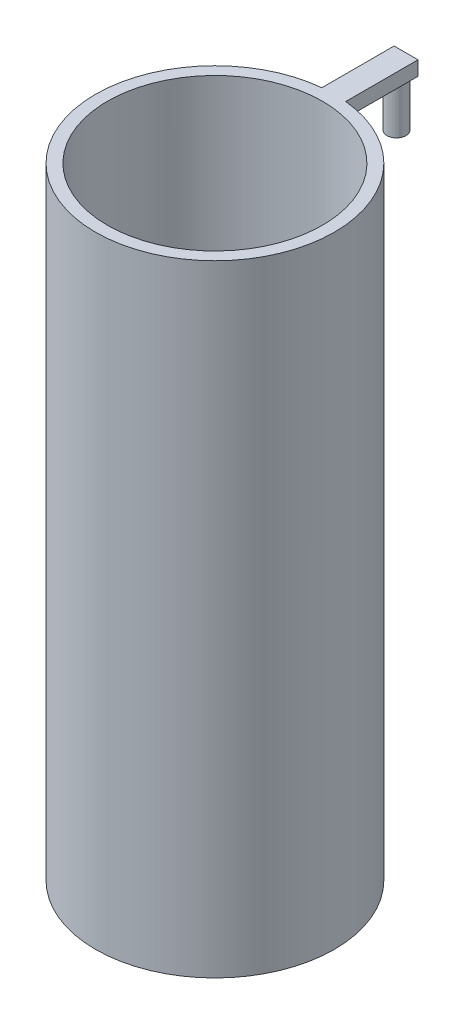
ISO-10303-21;
HEADER;
FILE_DESCRIPTION(('STEP AP214'),'2;1');
FILE_NAME('part.step','',(''),(''),'','','');
FILE_SCHEMA(('AUTOMOTIVE_DESIGN { 1 0 10303 214 1 1 1 1 }'));
ENDSEC;
DATA;
#1=APPLICATION_CONTEXT('core data for automotive mechanical design processes');
#2=APPLICATION_PROTOCOL_DEFINITION('international standard','automotive_design',2000,#1);
#3=PRODUCT_CONTEXT('',#1,'mechanical');
#4=PRODUCT('Part','Part','',(#3));
#5=PRODUCT_RELATED_PRODUCT_CATEGORY('part','',(#4));
#6=PRODUCT_DEFINITION_FORMATION('','',#4);
#7=PRODUCT_DEFINITION_CONTEXT('part definition',#1,'design');
#8=PRODUCT_DEFINITION('design','',#6,#7);
#9=PRODUCT_DEFINITION_SHAPE('','',#8);
#10=(LENGTH_UNIT() NAMED_UNIT(*) SI_UNIT(.MILLI.,.METRE.));
#11=(NAMED_UNIT(*) PLANE_ANGLE_UNIT() SI_UNIT($,.RADIAN.));
#12=(NAMED_UNIT(*) SI_UNIT($,.STERADIAN.) SOLID_ANGLE_UNIT());
#13=UNCERTAINTY_MEASURE_WITH_UNIT(LENGTH_MEASURE(1.E-05),#10,'distance_accuracy_value','');
#14=(GEOMETRIC_REPRESENTATION_CONTEXT(3) GLOBAL_UNCERTAINTY_ASSIGNED_CONTEXT((#13)) GLOBAL_UNIT_ASSIGNED_CONTEXT((#10,
#11,#12)) REPRESENTATION_CONTEXT('',''));
#15=CARTESIAN_POINT('',(0.,0.,0.));
#16=DIRECTION('',(0.,0.,1.));
#17=DIRECTION('',(1.,0.,0.));
#18=AXIS2_PLACEMENT_3D('',#15,#16,#17);
#19=CARTESIAN_POINT('',(0.,130.,0.));
#20=DIRECTION('',(0.,-1.,0.));
#21=DIRECTION('',(0.,0.,-1.));
#22=AXIS2_PLACEMENT_3D('',#19,#20,#21);
#23=CYLINDRICAL_SURFACE('',#22,25.);
#24=CARTESIAN_POINT('',(0.,0.,0.));
#25=DIRECTION('',(0.,1.,0.));
#26=DIRECTION('',(0.,0.,1.));
#27=AXIS2_PLACEMENT_3D('',#24,#25,#26);
#28=CIRCLE('',#27,25.);
#29=CARTESIAN_POINT('',(0.,0.,25.));
#30=VERTEX_POINT('',#29);
#31=EDGE_CURVE('E49',#30,#30,#28,.T.);
#32=ORIENTED_EDGE('',*,*,#31,.T.);
#33=EDGE_LOOP('',(#32));
#34=FACE_BOUND('',#33,.T.);
#35=DIRECTION('',(0.,1.,0.));
#36=VECTOR('',#35,1.);
#37=CARTESIAN_POINT('',(2.50000000000001,127.,-24.8746859276655));
#38=LINE('',#37,#36);
#39=CARTESIAN_POINT('',(2.50000000000001,127.,-24.8746859276655));
#40=VERTEX_POINT('',#39);
#41=CARTESIAN_POINT('',(2.50000000000001,130.,-24.8746859276655));
#42=VERTEX_POINT('',#41);
#43=EDGE_CURVE('E117',#40,#42,#38,.T.);
#44=ORIENTED_EDGE('',*,*,#43,.T.);
#45=CARTESIAN_POINT('',(0.,130.,0.));
#46=DIRECTION('',(0.,1.,0.));
#47=DIRECTION('',(0.,0.,1.));
#48=AXIS2_PLACEMENT_3D('',#45,#46,#47);
#49=CIRCLE('',#48,25.);
#50=CARTESIAN_POINT('',(-2.5,130.,-24.8746859276655));
#51=VERTEX_POINT('',#50);
#52=EDGE_CURVE('E11',#51,#42,#49,.T.);
#53=ORIENTED_EDGE('',*,*,#52,.F.);
#54=DIRECTION('',(0.,1.,0.));
#55=VECTOR('',#54,1.);
#56=CARTESIAN_POINT('',(-2.5,127.,-24.8746859276655));
#57=LINE('',#56,#55);
#58=CARTESIAN_POINT('',(-2.5,127.,-24.8746859276655));
#59=VERTEX_POINT('',#58);
#60=EDGE_CURVE('E120',#59,#51,#57,.T.);
#61=ORIENTED_EDGE('',*,*,#60,.F.);
#62=CARTESIAN_POINT('',(0.,127.,0.));
#63=DIRECTION('',(0.,1.,0.));
#64=DIRECTION('',(0.,0.,1.));
#65=AXIS2_PLACEMENT_3D('',#62,#63,#64);
#66=CIRCLE('',#65,25.);
#67=EDGE_CURVE('E108',#40,#59,#66,.T.);
#68=ORIENTED_EDGE('',*,*,#67,.F.);
#69=EDGE_LOOP('',(#44,#53,#61,#68));
#70=FACE_BOUND('',#69,.T.);
#71=ADVANCED_FACE('F41',(#34,#70),#23,.T.);
#72=CARTESIAN_POINT('',(0.,130.,0.));
#73=DIRECTION('',(0.,-1.,0.));
#74=DIRECTION('',(0.,0.,-1.));
#75=AXIS2_PLACEMENT_3D('',#72,#73,#74);
#76=CYLINDRICAL_SURFACE('',#75,22.5);
#77=CARTESIAN_POINT('',(0.,130.,0.));
#78=DIRECTION('',(0.,1.,0.));
#79=DIRECTION('',(0.,0.,1.));
#80=AXIS2_PLACEMENT_3D('',#77,#78,#79);
#81=CIRCLE('',#80,22.5);
#82=CARTESIAN_POINT('',(0.,130.,22.5));
#83=VERTEX_POINT('',#82);
#84=EDGE_CURVE('E123',#83,#83,#81,.T.);
#85=ORIENTED_EDGE('',*,*,#84,.T.);
#86=EDGE_LOOP('',(#85));
#87=FACE_BOUND('',#86,.T.);
#88=CARTESIAN_POINT('',(0.,5.,0.));
#89=DIRECTION('',(0.,-1.,0.));
#90=DIRECTION('',(0.,0.,-1.));
#91=AXIS2_PLACEMENT_3D('',#88,#89,#90);
#92=CIRCLE('',#91,22.5);
#93=CARTESIAN_POINT('',(0.,5.,-22.5));
#94=VERTEX_POINT('',#93);
#95=EDGE_CURVE('E44',#94,#94,#92,.T.);
#96=ORIENTED_EDGE('',*,*,#95,.T.);
#97=EDGE_LOOP('',(#96));
#98=FACE_BOUND('',#97,.T.);
#99=ADVANCED_FACE('F141',(#87,#98),#76,.F.);
#100=CARTESIAN_POINT('',(0.,130.,0.));
#101=DIRECTION('',(0.,1.,0.));
#102=DIRECTION('',(0.,0.,1.));
#103=AXIS2_PLACEMENT_3D('',#100,#101,#102);
#104=PLANE('',#103);
#105=ORIENTED_EDGE('',*,*,#52,.T.);
#106=DIRECTION('',(0.,0.,1.));
#107=VECTOR('',#106,1.);
#108=CARTESIAN_POINT('',(2.5,130.,0.));
#109=LINE('',#108,#107);
#110=CARTESIAN_POINT('',(2.5,130.,-40.));
#111=VERTEX_POINT('',#110);
#112=EDGE_CURVE('E80',#111,#42,#109,.T.);
#113=ORIENTED_EDGE('',*,*,#112,.F.);
#114=DIRECTION('',(1.,0.,0.));
#115=VECTOR('',#114,1.);
#116=CARTESIAN_POINT('',(0.,130.,-40.));
#117=LINE('',#116,#115);
#118=CARTESIAN_POINT('',(-2.5,130.,-40.));
#119=VERTEX_POINT('',#118);
#120=EDGE_CURVE('E112',#119,#111,#117,.T.);
#121=ORIENTED_EDGE('',*,*,#120,.F.);
#122=DIRECTION('',(0.,0.,1.));
#123=VECTOR('',#122,1.);
#124=CARTESIAN_POINT('',(-2.5,130.,0.));
#125=LINE('',#124,#123);
#126=EDGE_CURVE('E56',#119,#51,#125,.T.);
#127=ORIENTED_EDGE('',*,*,#126,.T.);
#128=EDGE_LOOP('',(#105,#113,#121,#127));
#129=FACE_BOUND('',#128,.T.);
#130=ORIENTED_EDGE('',*,*,#84,.F.);
#131=EDGE_LOOP('',(#130));
#132=FACE_BOUND('',#131,.T.);
#133=ADVANCED_FACE('F133',(#129,#132),#104,.T.);
#134=CARTESIAN_POINT('',(0.,0.,0.));
#135=DIRECTION('',(0.,1.,0.));
#136=DIRECTION('',(0.,0.,1.));
#137=AXIS2_PLACEMENT_3D('',#134,#135,#136);
#138=PLANE('',#137);
#139=ORIENTED_EDGE('',*,*,#31,.F.);
#140=EDGE_LOOP('',(#139));
#141=FACE_BOUND('',#140,.T.);
#142=ADVANCED_FACE('F130',(#141),#138,.F.);
#143=CARTESIAN_POINT('',(0.,5.,0.));
#144=DIRECTION('',(0.,-1.,0.));
#145=DIRECTION('',(0.,0.,-1.));
#146=AXIS2_PLACEMENT_3D('',#143,#144,#145);
#147=PLANE('',#146);
#148=ORIENTED_EDGE('',*,*,#95,.F.);
#149=EDGE_LOOP('',(#148));
#150=FACE_BOUND('',#149,.T.);
#151=ADVANCED_FACE('F132',(#150),#147,.F.);
#152=CARTESIAN_POINT('',(0.,127.,-40.));
#153=DIRECTION('',(0.,0.,1.));
#154=DIRECTION('',(1.,0.,0.));
#155=AXIS2_PLACEMENT_3D('',#152,#153,#154);
#156=PLANE('',#155);
#157=ORIENTED_EDGE('',*,*,#120,.T.);
#158=DIRECTION('',(0.,1.,0.));
#159=VECTOR('',#158,1.);
#160=CARTESIAN_POINT('',(2.5,127.,-40.));
#161=LINE('',#160,#159);
#162=CARTESIAN_POINT('',(2.5,127.,-40.));
#163=VERTEX_POINT('',#162);
#164=EDGE_CURVE('E102',#163,#111,#161,.T.);
#165=ORIENTED_EDGE('',*,*,#164,.F.);
#166=DIRECTION('',(1.,0.,0.));
#167=VECTOR('',#166,1.);
#168=CARTESIAN_POINT('',(0.,127.,-40.));
#169=LINE('',#168,#167);
#170=CARTESIAN_POINT('',(0.,127.,-40.));
#171=VERTEX_POINT('',#170);
#172=EDGE_CURVE('E65',#171,#163,#169,.T.);
#173=ORIENTED_EDGE('',*,*,#172,.F.);
#174=CARTESIAN_POINT('',(-2.5,127.,-40.));
#175=VERTEX_POINT('',#174);
#176=EDGE_CURVE('E92',#175,#171,#169,.T.);
#177=ORIENTED_EDGE('',*,*,#176,.F.);
#178=DIRECTION('',(0.,1.,0.));
#179=VECTOR('',#178,1.);
#180=CARTESIAN_POINT('',(-2.5,127.,-40.));
#181=LINE('',#180,#179);
#182=EDGE_CURVE('E86',#175,#119,#181,.T.);
#183=ORIENTED_EDGE('',*,*,#182,.T.);
#184=EDGE_LOOP('',(#157,#165,#173,#177,#183));
#185=FACE_BOUND('',#184,.T.);
#186=ADVANCED_FACE('F101',(#185),#156,.F.);
#187=CARTESIAN_POINT('',(2.5,127.,0.));
#188=DIRECTION('',(-1.,0.,0.));
#189=DIRECTION('',(0.,0.,1.));
#190=AXIS2_PLACEMENT_3D('',#187,#188,#189);
#191=PLANE('',#190);
#192=ORIENTED_EDGE('',*,*,#112,.T.);
#193=ORIENTED_EDGE('',*,*,#43,.F.);
#194=DIRECTION('',(0.,0.,1.));
#195=VECTOR('',#194,1.);
#196=CARTESIAN_POINT('',(2.5,127.,0.));
#197=LINE('',#196,#195);
#198=EDGE_CURVE('E110',#163,#40,#197,.T.);
#199=ORIENTED_EDGE('',*,*,#198,.F.);
#200=ORIENTED_EDGE('',*,*,#164,.T.);
#201=EDGE_LOOP('',(#192,#193,#199,#200));
#202=FACE_BOUND('',#201,.T.);
#203=ADVANCED_FACE('F156',(#202),#191,.F.);
#204=CARTESIAN_POINT('',(-2.5,127.,0.));
#205=DIRECTION('',(-1.,0.,0.));
#206=DIRECTION('',(0.,0.,1.));
#207=AXIS2_PLACEMENT_3D('',#204,#205,#206);
#208=PLANE('',#207);
#209=ORIENTED_EDGE('',*,*,#126,.F.);
#210=ORIENTED_EDGE('',*,*,#182,.F.);
#211=DIRECTION('',(0.,0.,1.));
#212=VECTOR('',#211,1.);
#213=CARTESIAN_POINT('',(-2.5,127.,0.));
#214=LINE('',#213,#212);
#215=EDGE_CURVE('E96',#175,#59,#214,.T.);
#216=ORIENTED_EDGE('',*,*,#215,.T.);
#217=ORIENTED_EDGE('',*,*,#60,.T.);
#218=EDGE_LOOP('',(#209,#210,#216,#217));
#219=FACE_BOUND('',#218,.T.);
#220=ADVANCED_FACE('F157',(#219),#208,.T.);
#221=CARTESIAN_POINT('',(0.,127.,0.));
#222=DIRECTION('',(0.,1.,0.));
#223=DIRECTION('',(0.,0.,1.));
#224=AXIS2_PLACEMENT_3D('',#221,#222,#223);
#225=PLANE('',#224);
#226=ORIENTED_EDGE('',*,*,#176,.T.);
#227=CARTESIAN_POINT('',(0.,127.,-38.));
#228=DIRECTION('',(0.,-1.,0.));
#229=DIRECTION('',(0.,0.,-1.));
#230=AXIS2_PLACEMENT_3D('',#227,#228,#229);
#231=CIRCLE('',#230,2.00000000000001);
#232=EDGE_CURVE('E95',#171,#171,#231,.T.);
#233=ORIENTED_EDGE('',*,*,#232,.F.);
#234=ORIENTED_EDGE('',*,*,#172,.T.);
#235=ORIENTED_EDGE('',*,*,#198,.T.);
#236=ORIENTED_EDGE('',*,*,#67,.T.);
#237=ORIENTED_EDGE('',*,*,#215,.F.);
#238=EDGE_LOOP('',(#226,#233,#234,#235,#236,#237));
#239=FACE_BOUND('',#238,.T.);
#240=ADVANCED_FACE('F93',(#239),#225,.F.);
#241=CARTESIAN_POINT('',(0.,117.,-38.));
#242=DIRECTION('',(0.,1.,0.));
#243=DIRECTION('',(0.,0.,1.));
#244=AXIS2_PLACEMENT_3D('',#241,#242,#243);
#245=CYLINDRICAL_SURFACE('',#244,2.00000000000001);
#246=CARTESIAN_POINT('',(0.,117.,-38.));
#247=DIRECTION('',(0.,-1.,0.));
#248=DIRECTION('',(0.,0.,-1.));
#249=AXIS2_PLACEMENT_3D('',#246,#247,#248);
#250=CIRCLE('',#249,2.00000000000001);
#251=CARTESIAN_POINT('',(0.,117.,-40.));
#252=VERTEX_POINT('',#251);
#253=EDGE_CURVE('E114',#252,#252,#250,.T.);
#254=ORIENTED_EDGE('',*,*,#253,.F.);
#255=EDGE_LOOP('',(#254));
#256=FACE_BOUND('',#255,.T.);
#257=ORIENTED_EDGE('',*,*,#232,.T.);
#258=EDGE_LOOP('',(#257));
#259=FACE_BOUND('',#258,.T.);
#260=ADVANCED_FACE('F165',(#256,#259),#245,.T.);
#261=CARTESIAN_POINT('',(0.,117.,-38.));
#262=DIRECTION('',(0.,-1.,0.));
#263=DIRECTION('',(0.,0.,-1.));
#264=AXIS2_PLACEMENT_3D('',#261,#262,#263);
#265=PLANE('',#264);
#266=ORIENTED_EDGE('',*,*,#253,.T.);
#267=EDGE_LOOP('',(#266));
#268=FACE_BOUND('',#267,.T.);
#269=ADVANCED_FACE('F168',(#268),#265,.T.);
#270=CLOSED_SHELL('',(#71,#99,#133,#142,#151,#186,#203,#220,#240,#260,#269));
#271=MANIFOLD_SOLID_BREP('B2',#270);
#272=ADVANCED_BREP_SHAPE_REPRESENTATION('',(#18,#271),#14);
#273=SHAPE_DEFINITION_REPRESENTATION(#9,#272);
ENDSEC;
END-ISO-10303-21;
